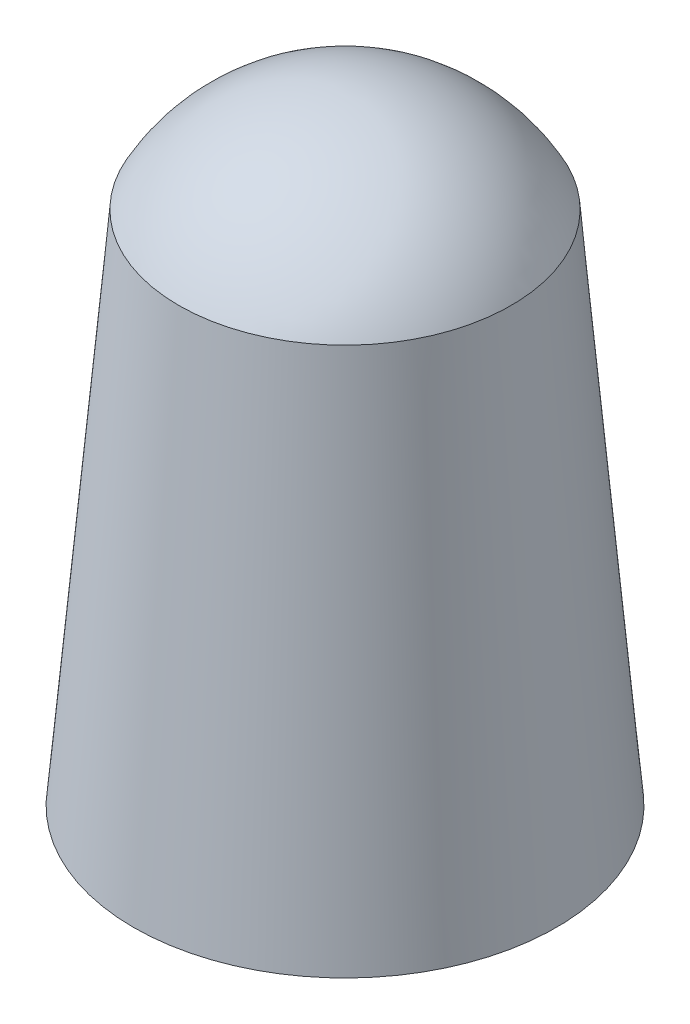
ISO-10303-21;
HEADER;
FILE_DESCRIPTION(('STEP AP214'),'2;1');
FILE_NAME('part.step','',(''),(''),'','','');
FILE_SCHEMA(('AUTOMOTIVE_DESIGN { 1 0 10303 214 1 1 1 1 }'));
ENDSEC;
DATA;
#1=APPLICATION_CONTEXT('core data for automotive mechanical design processes');
#2=APPLICATION_PROTOCOL_DEFINITION('international standard','automotive_design',2000,#1);
#3=PRODUCT_CONTEXT('',#1,'mechanical');
#4=PRODUCT('Part','Part','',(#3));
#5=PRODUCT_RELATED_PRODUCT_CATEGORY('part','',(#4));
#6=PRODUCT_DEFINITION_FORMATION('','',#4);
#7=PRODUCT_DEFINITION_CONTEXT('part definition',#1,'design');
#8=PRODUCT_DEFINITION('design','',#6,#7);
#9=PRODUCT_DEFINITION_SHAPE('','',#8);
#10=(LENGTH_UNIT() NAMED_UNIT(*) SI_UNIT(.MILLI.,.METRE.));
#11=(NAMED_UNIT(*) PLANE_ANGLE_UNIT() SI_UNIT($,.RADIAN.));
#12=(NAMED_UNIT(*) SI_UNIT($,.STERADIAN.) SOLID_ANGLE_UNIT());
#13=UNCERTAINTY_MEASURE_WITH_UNIT(LENGTH_MEASURE(1.E-05),#10,'distance_accuracy_value','');
#14=(GEOMETRIC_REPRESENTATION_CONTEXT(3) GLOBAL_UNCERTAINTY_ASSIGNED_CONTEXT((#13)) GLOBAL_UNIT_ASSIGNED_CONTEXT((#10,
#11,#12)) REPRESENTATION_CONTEXT('',''));
#15=CARTESIAN_POINT('',(0.,0.,0.));
#16=DIRECTION('',(0.,0.,1.));
#17=DIRECTION('',(1.,0.,0.));
#18=AXIS2_PLACEMENT_3D('',#15,#16,#17);
#19=CARTESIAN_POINT('',(0.,0.,0.));
#20=DIRECTION('',(0.,-1.,0.));
#21=DIRECTION('',(0.,0.,1.));
#22=AXIS2_PLACEMENT_3D('',#19,#20,#21);
#23=CONICAL_SURFACE('',#22,5.4102,0.0872664625997167);
#24=CARTESIAN_POINT('',(0.,13.208,0.));
#25=DIRECTION('',(0.,1.,0.));
#26=DIRECTION('',(0.,0.,1.));
#27=AXIS2_PLACEMENT_3D('',#24,#25,#26);
#28=CIRCLE('',#27,4.25464973214959);
#29=CARTESIAN_POINT('',(0.,13.208,4.25464973214959));
#30=VERTEX_POINT('',#29);
#31=EDGE_CURVE('E10',#30,#30,#28,.T.);
#32=ORIENTED_EDGE('',*,*,#31,.F.);
#33=EDGE_LOOP('',(#32));
#34=FACE_BOUND('',#33,.T.);
#35=CARTESIAN_POINT('',(0.,0.,0.));
#36=DIRECTION('',(0.,1.,0.));
#37=DIRECTION('',(0.,0.,1.));
#38=AXIS2_PLACEMENT_3D('',#35,#36,#37);
#39=CIRCLE('',#38,5.4102);
#40=CARTESIAN_POINT('',(0.,0.,5.4102));
#41=VERTEX_POINT('',#40);
#42=EDGE_CURVE('E38',#41,#41,#39,.T.);
#43=ORIENTED_EDGE('',*,*,#42,.T.);
#44=EDGE_LOOP('',(#43));
#45=FACE_BOUND('',#44,.T.);
#46=ADVANCED_FACE('F31',(#34,#45),#23,.T.);
#47=CARTESIAN_POINT('',(0.,10.9146054442361,0.));
#48=DIRECTION('',(0.,0.,1.));
#49=DIRECTION('',(1.,0.,0.));
#50=AXIS2_PLACEMENT_3D('',#47,#48,#49);
#51=SPHERICAL_SURFACE('',#50,4.8333945557639);
#52=CARTESIAN_POINT('',(0.,10.9146054442361,0.));
#53=DIRECTION('',(0.,1.,0.));
#54=DIRECTION('',(0.,0.,1.));
#55=AXIS2_PLACEMENT_3D('',#52,#53,#54);
#56=SPHERICAL_SURFACE('',#55,4.8333945557639);
#57=ORIENTED_EDGE('',*,*,#31,.T.);
#58=EDGE_LOOP('',(#57));
#59=FACE_BOUND('',#58,.T.);
#60=ADVANCED_FACE('F33',(#59),#56,.T.);
#61=CARTESIAN_POINT('',(0.,0.,0.));
#62=DIRECTION('',(0.,1.,0.));
#63=DIRECTION('',(0.,0.,1.));
#64=AXIS2_PLACEMENT_3D('',#61,#62,#63);
#65=PLANE('',#64);
#66=ORIENTED_EDGE('',*,*,#42,.F.);
#67=EDGE_LOOP('',(#66));
#68=FACE_BOUND('',#67,.T.);
#69=ADVANCED_FACE('F45',(#68),#65,.F.);
#70=CLOSED_SHELL('',(#46,#60,#69));
#71=MANIFOLD_SOLID_BREP('B2',#70);
#72=ADVANCED_BREP_SHAPE_REPRESENTATION('',(#18,#71),#14);
#73=SHAPE_DEFINITION_REPRESENTATION(#9,#72);
ENDSEC;
END-ISO-10303-21;
